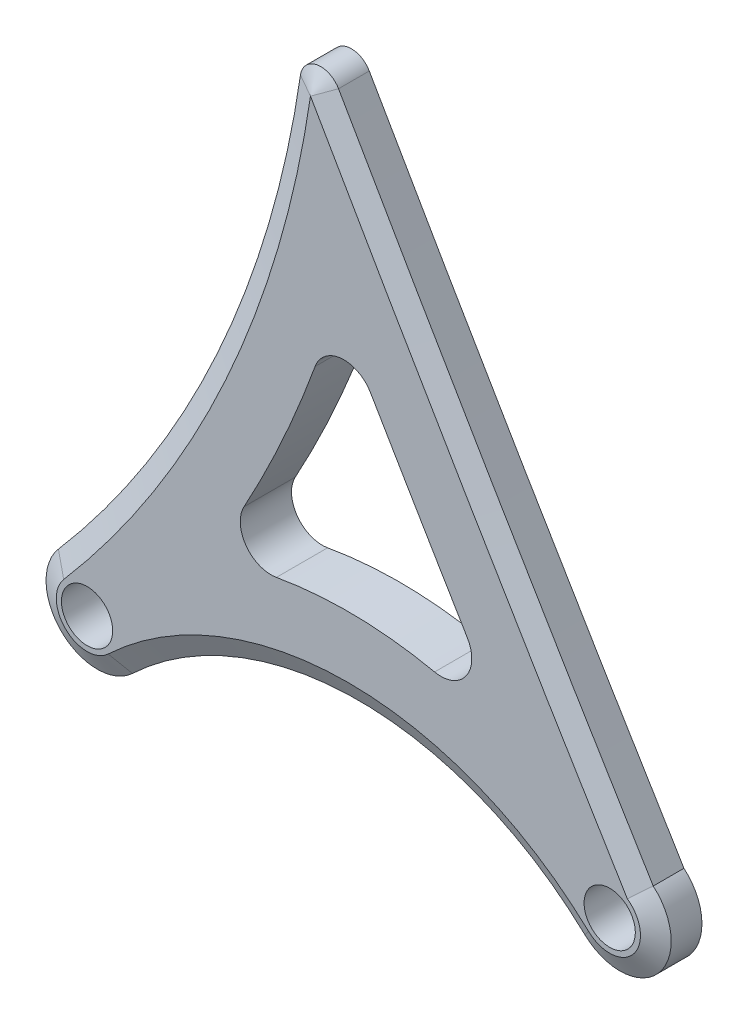
ISO-10303-21;
HEADER;
FILE_DESCRIPTION(('STEP AP214'),'2;1');
FILE_NAME('part.step','',(''),(''),'','','');
FILE_SCHEMA(('AUTOMOTIVE_DESIGN { 1 0 10303 214 1 1 1 1 }'));
ENDSEC;
DATA;
#1=APPLICATION_CONTEXT('core data for automotive mechanical design processes');
#2=APPLICATION_PROTOCOL_DEFINITION('international standard','automotive_design',2000,#1);
#3=PRODUCT_CONTEXT('',#1,'mechanical');
#4=PRODUCT('Part','Part','',(#3));
#5=PRODUCT_RELATED_PRODUCT_CATEGORY('part','',(#4));
#6=PRODUCT_DEFINITION_FORMATION('','',#4);
#7=PRODUCT_DEFINITION_CONTEXT('part definition',#1,'design');
#8=PRODUCT_DEFINITION('design','',#6,#7);
#9=PRODUCT_DEFINITION_SHAPE('','',#8);
#10=(LENGTH_UNIT() NAMED_UNIT(*) SI_UNIT(.MILLI.,.METRE.));
#11=(NAMED_UNIT(*) PLANE_ANGLE_UNIT() SI_UNIT($,.RADIAN.));
#12=(NAMED_UNIT(*) SI_UNIT($,.STERADIAN.) SOLID_ANGLE_UNIT());
#13=UNCERTAINTY_MEASURE_WITH_UNIT(LENGTH_MEASURE(1.E-05),#10,'distance_accuracy_value','');
#14=(GEOMETRIC_REPRESENTATION_CONTEXT(3) GLOBAL_UNCERTAINTY_ASSIGNED_CONTEXT((#13)) GLOBAL_UNIT_ASSIGNED_CONTEXT((#10,
#11,#12)) REPRESENTATION_CONTEXT('',''));
#15=CARTESIAN_POINT('',(0.,0.,0.));
#16=DIRECTION('',(0.,0.,1.));
#17=DIRECTION('',(1.,0.,0.));
#18=AXIS2_PLACEMENT_3D('',#15,#16,#17);
#19=CARTESIAN_POINT('',(0.,0.,2.5));
#20=DIRECTION('',(0.,0.,1.));
#21=DIRECTION('',(1.,0.,0.));
#22=AXIS2_PLACEMENT_3D('',#19,#20,#21);
#23=PLANE('',#22);
#24=CARTESIAN_POINT('',(-81.5058371751675,69.9530806072652,2.5));
#25=DIRECTION('',(0.,0.,1.));
#26=DIRECTION('',(1.,0.,0.));
#27=AXIS2_PLACEMENT_3D('',#24,#25,#26);
#28=CIRCLE('',#27,104.408728602807);
#29=CARTESIAN_POINT('',(21.8025261402931,54.8347249581167,2.5));
#30=VERTEX_POINT('',#29);
#31=CARTESIAN_POINT('',(-2.27651434577275,1.95383787287753,2.5));
#32=VERTEX_POINT('',#31);
#33=EDGE_CURVE('E243',#30,#32,#28,.F.);
#34=ORIENTED_EDGE('',*,*,#33,.T.);
#35=CARTESIAN_POINT('',(0.,0.,2.5));
#36=DIRECTION('',(0.,0.,1.));
#37=DIRECTION('',(1.,0.,0.));
#38=AXIS2_PLACEMENT_3D('',#35,#36,#37);
#39=CIRCLE('',#38,2.99999999999998);
#40=CARTESIAN_POINT('',(2.05722545944654,-2.18353461364936,2.5));
#41=VERTEX_POINT('',#40);
#42=EDGE_CURVE('E245',#32,#41,#39,.T.);
#43=ORIENTED_EDGE('',*,*,#42,.T.);
#44=CARTESIAN_POINT('',(25.5,-27.0656443572491,2.5));
#45=DIRECTION('',(0.,0.,1.));
#46=DIRECTION('',(1.,0.,0.));
#47=AXIS2_PLACEMENT_3D('',#44,#45,#46);
#48=CIRCLE('',#47,34.1860068368882);
#49=CARTESIAN_POINT('',(48.9427745405534,-2.18353461364937,2.5));
#50=VERTEX_POINT('',#49);
#51=EDGE_CURVE('E241',#41,#50,#48,.F.);
#52=ORIENTED_EDGE('',*,*,#51,.T.);
#53=CARTESIAN_POINT('',(51.,0.,2.5));
#54=DIRECTION('',(0.,0.,1.));
#55=DIRECTION('',(1.,0.,0.));
#56=AXIS2_PLACEMENT_3D('',#53,#54,#55);
#57=CIRCLE('',#56,2.99999999999999);
#58=CARTESIAN_POINT('',(52.726541754673,2.45337595353229,2.5));
#59=VERTEX_POINT('',#58);
#60=EDGE_CURVE('E239',#50,#59,#57,.T.);
#61=ORIENTED_EDGE('',*,*,#60,.T.);
#62=CARTESIAN_POINT('',(1817.84999058361,1079.83600160116,2.5));
#63=DIRECTION('',(0.,0.,1.));
#64=DIRECTION('',(1.,0.,0.));
#65=AXIS2_PLACEMENT_3D('',#62,#63,#64);
#66=CIRCLE('',#65,2067.94925267839);
#67=EDGE_CURVE('E237',#59,#30,#66,.F.);
#68=ORIENTED_EDGE('',*,*,#67,.T.);
#69=EDGE_LOOP('',(#34,#43,#52,#61,#68));
#70=FACE_BOUND('',#69,.T.);
#71=CARTESIAN_POINT('',(0.,0.,2.5));
#72=DIRECTION('',(0.,0.,1.));
#73=DIRECTION('',(1.,0.,0.));
#74=AXIS2_PLACEMENT_3D('',#71,#72,#73);
#75=CIRCLE('',#74,2.5);
#76=CARTESIAN_POINT('',(2.5,0.,2.5));
#77=VERTEX_POINT('',#76);
#78=EDGE_CURVE('E221',#77,#77,#75,.T.);
#79=ORIENTED_EDGE('',*,*,#78,.F.);
#80=EDGE_LOOP('',(#79));
#81=FACE_BOUND('',#80,.T.);
#82=CARTESIAN_POINT('',(51.,0.,2.5));
#83=DIRECTION('',(0.,0.,1.));
#84=DIRECTION('',(1.,0.,0.));
#85=AXIS2_PLACEMENT_3D('',#82,#83,#84);
#86=CIRCLE('',#85,2.5);
#87=CARTESIAN_POINT('',(53.5,0.,2.5));
#88=VERTEX_POINT('',#87);
#89=EDGE_CURVE('E227',#88,#88,#86,.T.);
#90=ORIENTED_EDGE('',*,*,#89,.F.);
#91=EDGE_LOOP('',(#90));
#92=FACE_BOUND('',#91,.T.);
#93=CARTESIAN_POINT('',(34.5411682834786,15.1633558983287,2.5));
#94=DIRECTION('',(0.,0.,1.));
#95=DIRECTION('',(-1.,0.,0.));
#96=AXIS2_PLACEMENT_3D('',#93,#94,#95);
#97=CIRCLE('',#96,3.0000000000001);
#98=CARTESIAN_POINT('',(33.9131059355778,12.2298362227256,2.5));
#99=VERTEX_POINT('',#98);
#100=CARTESIAN_POINT('',(37.1170263406755,16.7011970049373,2.5));
#101=VERTEX_POINT('',#100);
#102=EDGE_CURVE('E160',#99,#101,#97,.T.);
#103=ORIENTED_EDGE('',*,*,#102,.F.);
#104=CARTESIAN_POINT('',(25.5,-27.0656443572491,2.5));
#105=DIRECTION('',(0.,0.,-1.));
#106=DIRECTION('',(1.,0.,0.));
#107=AXIS2_PLACEMENT_3D('',#104,#105,#106);
#108=CIRCLE('',#107,40.1860068368882);
#109=CARTESIAN_POINT('',(18.4748148405109,12.50153799087,2.5));
#110=VERTEX_POINT('',#109);
#111=EDGE_CURVE('E178',#110,#99,#108,.T.);
#112=ORIENTED_EDGE('',*,*,#111,.F.);
#113=CARTESIAN_POINT('',(17.9503647361746,15.4553409782173,2.5));
#114=DIRECTION('',(0.,0.,1.));
#115=DIRECTION('',(-1.,0.,0.));
#116=AXIS2_PLACEMENT_3D('',#113,#114,#115);
#117=CIRCLE('',#116,3.00000000000001);
#118=CARTESIAN_POINT('',(15.3194507896916,16.8969691571183,2.5));
#119=VERTEX_POINT('',#118);
#120=EDGE_CURVE('E181',#119,#110,#117,.T.);
#121=ORIENTED_EDGE('',*,*,#120,.F.);
#122=CARTESIAN_POINT('',(-81.5058371751675,69.9530806072652,2.5));
#123=DIRECTION('',(0.,0.,-1.));
#124=DIRECTION('',(1.,0.,0.));
#125=AXIS2_PLACEMENT_3D('',#122,#123,#124);
#126=CIRCLE('',#125,110.408728602807);
#127=CARTESIAN_POINT('',(22.25234591704,32.2128263276202,2.5));
#128=VERTEX_POINT('',#127);
#129=EDGE_CURVE('E198',#128,#119,#126,.T.);
#130=ORIENTED_EDGE('',*,*,#129,.F.);
#131=CARTESIAN_POINT('',(25.0716388589634,31.1873570167087,2.5));
#132=DIRECTION('',(0.,0.,1.));
#133=DIRECTION('',(1.,0.,0.));
#134=AXIS2_PLACEMENT_3D('',#131,#132,#133);
#135=CIRCLE('',#134,3.00000000000012);
#136=CARTESIAN_POINT('',(27.6611749529423,32.7020526356305,2.5));
#137=VERTEX_POINT('',#136);
#138=EDGE_CURVE('E195',#137,#128,#135,.T.);
#139=ORIENTED_EDGE('',*,*,#138,.F.);
#140=CARTESIAN_POINT('',(1817.84999058361,1079.83600160116,2.5));
#141=DIRECTION('',(0.,0.,-1.));
#142=DIRECTION('',(1.,0.,0.));
#143=AXIS2_PLACEMENT_3D('',#140,#141,#142);
#144=CIRCLE('',#143,2073.94925267839);
#145=EDGE_CURVE('E192',#101,#137,#144,.T.);
#146=ORIENTED_EDGE('',*,*,#145,.F.);
#147=EDGE_LOOP('',(#103,#112,#121,#130,#139,#146));
#148=FACE_BOUND('',#147,.T.);
#149=ADVANCED_FACE('F34',(#70,#81,#92,#148),#23,.T.);
#150=CARTESIAN_POINT('',(0.,0.,-2.5));
#151=DIRECTION('',(0.,0.,1.));
#152=DIRECTION('',(1.,0.,0.));
#153=AXIS2_PLACEMENT_3D('',#150,#151,#152);
#154=PLANE('',#153);
#155=CARTESIAN_POINT('',(25.5,-27.0656443572491,-2.5));
#156=DIRECTION('',(0.,0.,1.));
#157=DIRECTION('',(1.,0.,0.));
#158=AXIS2_PLACEMENT_3D('',#155,#156,#157);
#159=CIRCLE('',#158,34.1860068368878);
#160=CARTESIAN_POINT('',(48.9427745405532,-2.18353461364959,-2.5));
#161=VERTEX_POINT('',#160);
#162=CARTESIAN_POINT('',(2.05722545944676,-2.18353461364958,-2.5));
#163=VERTEX_POINT('',#162);
#164=EDGE_CURVE('E345',#161,#163,#159,.T.);
#165=ORIENTED_EDGE('',*,*,#164,.T.);
#166=CARTESIAN_POINT('',(0.,0.,-2.5));
#167=DIRECTION('',(0.,0.,1.));
#168=DIRECTION('',(1.,0.,0.));
#169=AXIS2_PLACEMENT_3D('',#166,#167,#168);
#170=CIRCLE('',#169,3.00000000000029);
#171=CARTESIAN_POINT('',(-2.27651434577301,1.95383787287775,-2.5));
#172=VERTEX_POINT('',#171);
#173=EDGE_CURVE('E340',#163,#172,#170,.F.);
#174=ORIENTED_EDGE('',*,*,#173,.T.);
#175=CARTESIAN_POINT('',(-81.5058371751675,69.9530806072652,-2.5));
#176=DIRECTION('',(0.,0.,1.));
#177=DIRECTION('',(1.,0.,0.));
#178=AXIS2_PLACEMENT_3D('',#175,#176,#177);
#179=CIRCLE('',#178,104.408728602807);
#180=CARTESIAN_POINT('',(21.8025261402934,54.8347249581169,-2.5));
#181=VERTEX_POINT('',#180);
#182=EDGE_CURVE('E343',#172,#181,#179,.T.);
#183=ORIENTED_EDGE('',*,*,#182,.T.);
#184=CARTESIAN_POINT('',(1817.84999058361,1079.83600160116,-2.5));
#185=DIRECTION('',(0.,0.,1.));
#186=DIRECTION('',(1.,0.,0.));
#187=AXIS2_PLACEMENT_3D('',#184,#185,#186);
#188=CIRCLE('',#187,2067.94925267839);
#189=CARTESIAN_POINT('',(52.7265417546742,2.45337595353186,-2.5));
#190=VERTEX_POINT('',#189);
#191=EDGE_CURVE('E349',#181,#190,#188,.T.);
#192=ORIENTED_EDGE('',*,*,#191,.T.);
#193=CARTESIAN_POINT('',(51.,0.,-2.5));
#194=DIRECTION('',(0.,0.,1.));
#195=DIRECTION('',(1.,0.,0.));
#196=AXIS2_PLACEMENT_3D('',#193,#194,#195);
#197=CIRCLE('',#196,3.0000000000003);
#198=EDGE_CURVE('E347',#190,#161,#197,.F.);
#199=ORIENTED_EDGE('',*,*,#198,.T.);
#200=EDGE_LOOP('',(#165,#174,#183,#192,#199));
#201=FACE_BOUND('',#200,.T.);
#202=CARTESIAN_POINT('',(51.,0.,-2.5));
#203=DIRECTION('',(0.,0.,1.));
#204=DIRECTION('',(1.,0.,0.));
#205=AXIS2_PLACEMENT_3D('',#202,#203,#204);
#206=CIRCLE('',#205,2.5);
#207=CARTESIAN_POINT('',(53.5,0.,-2.5));
#208=VERTEX_POINT('',#207);
#209=EDGE_CURVE('E224',#208,#208,#206,.T.);
#210=ORIENTED_EDGE('',*,*,#209,.T.);
#211=EDGE_LOOP('',(#210));
#212=FACE_BOUND('',#211,.T.);
#213=CARTESIAN_POINT('',(0.,0.,-2.5));
#214=DIRECTION('',(0.,0.,1.));
#215=DIRECTION('',(1.,0.,0.));
#216=AXIS2_PLACEMENT_3D('',#213,#214,#215);
#217=CIRCLE('',#216,2.5);
#218=CARTESIAN_POINT('',(2.5,0.,-2.5));
#219=VERTEX_POINT('',#218);
#220=EDGE_CURVE('E215',#219,#219,#217,.T.);
#221=ORIENTED_EDGE('',*,*,#220,.T.);
#222=EDGE_LOOP('',(#221));
#223=FACE_BOUND('',#222,.T.);
#224=CARTESIAN_POINT('',(25.5,-27.0656443572491,-2.5));
#225=DIRECTION('',(0.,0.,-1.));
#226=DIRECTION('',(1.,0.,0.));
#227=AXIS2_PLACEMENT_3D('',#224,#225,#226);
#228=CIRCLE('',#227,40.1860068368882);
#229=CARTESIAN_POINT('',(18.4748148405109,12.50153799087,-2.5));
#230=VERTEX_POINT('',#229);
#231=CARTESIAN_POINT('',(33.9131059355778,12.2298362227256,-2.5));
#232=VERTEX_POINT('',#231);
#233=EDGE_CURVE('E165',#230,#232,#228,.T.);
#234=ORIENTED_EDGE('',*,*,#233,.T.);
#235=CARTESIAN_POINT('',(34.5411682834786,15.1633558983287,-2.5));
#236=DIRECTION('',(0.,0.,1.));
#237=DIRECTION('',(-1.,0.,0.));
#238=AXIS2_PLACEMENT_3D('',#235,#236,#237);
#239=CIRCLE('',#238,3.0000000000001);
#240=CARTESIAN_POINT('',(37.1170263406755,16.7011970049373,-2.5));
#241=VERTEX_POINT('',#240);
#242=EDGE_CURVE('E157',#232,#241,#239,.T.);
#243=ORIENTED_EDGE('',*,*,#242,.T.);
#244=CARTESIAN_POINT('',(1817.84999058361,1079.83600160116,-2.5));
#245=DIRECTION('',(0.,0.,-1.));
#246=DIRECTION('',(1.,0.,0.));
#247=AXIS2_PLACEMENT_3D('',#244,#245,#246);
#248=CIRCLE('',#247,2073.94925267839);
#249=CARTESIAN_POINT('',(27.6611749529423,32.7020526356305,-2.5));
#250=VERTEX_POINT('',#249);
#251=EDGE_CURVE('E169',#241,#250,#248,.T.);
#252=ORIENTED_EDGE('',*,*,#251,.T.);
#253=CARTESIAN_POINT('',(25.0716388589634,31.1873570167087,-2.5));
#254=DIRECTION('',(0.,0.,1.));
#255=DIRECTION('',(1.,0.,0.));
#256=AXIS2_PLACEMENT_3D('',#253,#254,#255);
#257=CIRCLE('',#256,3.00000000000012);
#258=CARTESIAN_POINT('',(22.25234591704,32.2128263276202,-2.5));
#259=VERTEX_POINT('',#258);
#260=EDGE_CURVE('E173',#250,#259,#257,.T.);
#261=ORIENTED_EDGE('',*,*,#260,.T.);
#262=CARTESIAN_POINT('',(-81.5058371751675,69.9530806072652,-2.5));
#263=DIRECTION('',(0.,0.,-1.));
#264=DIRECTION('',(1.,0.,0.));
#265=AXIS2_PLACEMENT_3D('',#262,#263,#264);
#266=CIRCLE('',#265,110.408728602807);
#267=CARTESIAN_POINT('',(15.3194507896916,16.8969691571183,-2.5));
#268=VERTEX_POINT('',#267);
#269=EDGE_CURVE('E185',#259,#268,#266,.T.);
#270=ORIENTED_EDGE('',*,*,#269,.T.);
#271=CARTESIAN_POINT('',(17.9503647361746,15.4553409782173,-2.5));
#272=DIRECTION('',(0.,0.,1.));
#273=DIRECTION('',(-1.,0.,0.));
#274=AXIS2_PLACEMENT_3D('',#271,#272,#273);
#275=CIRCLE('',#274,3.00000000000001);
#276=EDGE_CURVE('E188',#268,#230,#275,.T.);
#277=ORIENTED_EDGE('',*,*,#276,.T.);
#278=EDGE_LOOP('',(#234,#243,#252,#261,#270,#277));
#279=FACE_BOUND('',#278,.T.);
#280=ADVANCED_FACE('F175',(#201,#212,#223,#279),#154,.F.);
#281=CARTESIAN_POINT('',(0.,0.,2.5));
#282=DIRECTION('',(0.,0.,-1.));
#283=DIRECTION('',(-1.,0.,0.));
#284=AXIS2_PLACEMENT_3D('',#281,#282,#283);
#285=CYLINDRICAL_SURFACE('',#284,5.);
#286=DIRECTION('',(0.,0.,1.));
#287=VECTOR('',#286,1.);
#288=CARTESIAN_POINT('',(-3.79419057628796,3.25639645479592,-2.5));
#289=LINE('',#288,#287);
#290=CARTESIAN_POINT('',(-3.79419057628796,3.25639645479592,-1.50000000000005));
#291=VERTEX_POINT('',#290);
#292=CARTESIAN_POINT('',(-3.79419057628796,3.25639645479592,1.50000000000005));
#293=VERTEX_POINT('',#292);
#294=EDGE_CURVE('E205',#291,#293,#289,.T.);
#295=ORIENTED_EDGE('',*,*,#294,.F.);
#296=CARTESIAN_POINT('',(0.,0.,-1.50000000000005));
#297=DIRECTION('',(0.,0.,1.));
#298=DIRECTION('',(1.,0.,0.));
#299=AXIS2_PLACEMENT_3D('',#296,#297,#298);
#300=CIRCLE('',#299,5.);
#301=CARTESIAN_POINT('',(3.42870909907759,-3.63922435608229,-1.50000000000005));
#302=VERTEX_POINT('',#301);
#303=EDGE_CURVE('E265',#291,#302,#300,.T.);
#304=ORIENTED_EDGE('',*,*,#303,.T.);
#305=DIRECTION('',(0.,0.,1.));
#306=VECTOR('',#305,1.);
#307=CARTESIAN_POINT('',(3.42870909907759,-3.63922435608229,-2.5));
#308=LINE('',#307,#306);
#309=CARTESIAN_POINT('',(3.42870909907759,-3.63922435608229,1.50000000000005));
#310=VERTEX_POINT('',#309);
#311=EDGE_CURVE('E218',#302,#310,#308,.T.);
#312=ORIENTED_EDGE('',*,*,#311,.T.);
#313=CARTESIAN_POINT('',(0.,0.,1.50000000000005));
#314=DIRECTION('',(0.,0.,1.));
#315=DIRECTION('',(1.,0.,0.));
#316=AXIS2_PLACEMENT_3D('',#313,#314,#315);
#317=CIRCLE('',#316,5.);
#318=EDGE_CURVE('E248',#310,#293,#317,.F.);
#319=ORIENTED_EDGE('',*,*,#318,.T.);
#320=EDGE_LOOP('',(#295,#304,#312,#319));
#321=FACE_BOUND('',#320,.T.);
#322=ADVANCED_FACE('F355',(#321),#285,.T.);
#323=CARTESIAN_POINT('',(51.,0.,2.5));
#324=DIRECTION('',(0.,0.,-1.));
#325=DIRECTION('',(-1.,0.,0.));
#326=AXIS2_PLACEMENT_3D('',#323,#324,#325);
#327=CYLINDRICAL_SURFACE('',#326,5.00000000000001);
#328=DIRECTION('',(0.,0.,1.));
#329=VECTOR('',#328,1.);
#330=CARTESIAN_POINT('',(47.5712909009225,-3.63922435608214,-2.5));
#331=LINE('',#330,#329);
#332=CARTESIAN_POINT('',(47.5712909009225,-3.63922435608214,-1.50000000000005));
#333=VERTEX_POINT('',#332);
#334=CARTESIAN_POINT('',(47.5712909009225,-3.63922435608214,1.50000000000005));
#335=VERTEX_POINT('',#334);
#336=EDGE_CURVE('E216',#333,#335,#331,.T.);
#337=ORIENTED_EDGE('',*,*,#336,.F.);
#338=CARTESIAN_POINT('',(51.,0.,-1.50000000000005));
#339=DIRECTION('',(0.,0.,1.));
#340=DIRECTION('',(1.,0.,0.));
#341=AXIS2_PLACEMENT_3D('',#338,#339,#340);
#342=CIRCLE('',#341,5.00000000000001);
#343=CARTESIAN_POINT('',(54.2457341107163,3.80331566958758,-1.50000000000005));
#344=VERTEX_POINT('',#343);
#345=EDGE_CURVE('E43',#333,#344,#342,.T.);
#346=ORIENTED_EDGE('',*,*,#345,.T.);
#347=DIRECTION('',(0.,0.,1.));
#348=VECTOR('',#347,1.);
#349=CARTESIAN_POINT('',(54.2457341107163,3.80331566958758,-2.5));
#350=LINE('',#349,#348);
#351=CARTESIAN_POINT('',(54.2457341107163,3.80331566958758,1.50000000000005));
#352=VERTEX_POINT('',#351);
#353=EDGE_CURVE('E213',#344,#352,#350,.T.);
#354=ORIENTED_EDGE('',*,*,#353,.T.);
#355=CARTESIAN_POINT('',(51.,0.,1.50000000000005));
#356=DIRECTION('',(0.,0.,1.));
#357=DIRECTION('',(1.,0.,0.));
#358=AXIS2_PLACEMENT_3D('',#355,#356,#357);
#359=CIRCLE('',#358,5.00000000000001);
#360=EDGE_CURVE('E259',#352,#335,#359,.F.);
#361=ORIENTED_EDGE('',*,*,#360,.T.);
#362=EDGE_LOOP('',(#337,#346,#354,#361));
#363=FACE_BOUND('',#362,.T.);
#364=ADVANCED_FACE('F424',(#363),#327,.T.);
#365=CARTESIAN_POINT('',(51.,0.,2.5));
#366=DIRECTION('',(0.,0.,-1.));
#367=DIRECTION('',(-1.,0.,0.));
#368=AXIS2_PLACEMENT_3D('',#365,#366,#367);
#369=CYLINDRICAL_SURFACE('',#368,2.5);
#370=ORIENTED_EDGE('',*,*,#89,.T.);
#371=EDGE_LOOP('',(#370));
#372=FACE_BOUND('',#371,.T.);
#373=ORIENTED_EDGE('',*,*,#209,.F.);
#374=EDGE_LOOP('',(#373));
#375=FACE_BOUND('',#374,.T.);
#376=ADVANCED_FACE('F416',(#372,#375),#369,.F.);
#377=CARTESIAN_POINT('',(0.,0.,2.5));
#378=DIRECTION('',(0.,0.,-1.));
#379=DIRECTION('',(-1.,0.,0.));
#380=AXIS2_PLACEMENT_3D('',#377,#378,#379);
#381=CYLINDRICAL_SURFACE('',#380,2.5);
#382=ORIENTED_EDGE('',*,*,#78,.T.);
#383=EDGE_LOOP('',(#382));
#384=FACE_BOUND('',#383,.T.);
#385=ORIENTED_EDGE('',*,*,#220,.F.);
#386=EDGE_LOOP('',(#385));
#387=FACE_BOUND('',#386,.T.);
#388=ADVANCED_FACE('F414',(#384,#387),#381,.F.);
#389=CARTESIAN_POINT('',(1817.84999058361,1079.83600160116,-2.5));
#390=DIRECTION('',(0.,0.,1.));
#391=DIRECTION('',(1.,0.,0.));
#392=AXIS2_PLACEMENT_3D('',#389,#390,#391);
#393=CYLINDRICAL_SURFACE('',#392,2065.94925267839);
#394=ORIENTED_EDGE('',*,*,#353,.F.);
#395=CARTESIAN_POINT('',(1817.84999058361,1079.83600160116,-1.50000000000005));
#396=DIRECTION('',(0.,0.,1.));
#397=DIRECTION('',(1.,0.,0.));
#398=AXIS2_PLACEMENT_3D('',#395,#396,#397);
#399=CIRCLE('',#398,2065.94925267839);
#400=CARTESIAN_POINT('',(23.5395585767682,55.8260464572449,-1.50000000000005));
#401=VERTEX_POINT('',#400);
#402=EDGE_CURVE('E12',#344,#401,#399,.F.);
#403=ORIENTED_EDGE('',*,*,#402,.T.);
#404=DIRECTION('',(0.,0.,1.));
#405=VECTOR('',#404,1.);
#406=CARTESIAN_POINT('',(23.5395585767682,55.8260464572449,-2.5));
#407=LINE('',#406,#405);
#408=CARTESIAN_POINT('',(23.5395585767682,55.8260464572449,1.50000000000005));
#409=VERTEX_POINT('',#408);
#410=EDGE_CURVE('E230',#401,#409,#407,.T.);
#411=ORIENTED_EDGE('',*,*,#410,.T.);
#412=CARTESIAN_POINT('',(1817.84999058361,1079.83600160116,1.50000000000005));
#413=DIRECTION('',(0.,0.,1.));
#414=DIRECTION('',(1.,0.,0.));
#415=AXIS2_PLACEMENT_3D('',#412,#413,#414);
#416=CIRCLE('',#415,2065.94925267839);
#417=EDGE_CURVE('E262',#409,#352,#416,.T.);
#418=ORIENTED_EDGE('',*,*,#417,.T.);
#419=EDGE_LOOP('',(#394,#403,#411,#418));
#420=FACE_BOUND('',#419,.T.);
#421=ADVANCED_FACE('F392',(#420),#393,.F.);
#422=CARTESIAN_POINT('',(-81.5058371751675,69.9530806072652,-2.5));
#423=DIRECTION('',(0.,0.,1.));
#424=DIRECTION('',(1.,0.,0.));
#425=AXIS2_PLACEMENT_3D('',#422,#423,#424);
#426=CYLINDRICAL_SURFACE('',#425,102.408728602807);
#427=DIRECTION('',(0.,0.,1.));
#428=VECTOR('',#427,1.);
#429=CARTESIAN_POINT('',(19.8236041727983,55.1243244169251,-2.5));
#430=LINE('',#429,#428);
#431=CARTESIAN_POINT('',(19.8236041727983,55.1243244169251,1.50000000000005));
#432=VERTEX_POINT('',#431);
#433=CARTESIAN_POINT('',(19.8236041727983,55.1243244169251,-1.50000000000005));
#434=VERTEX_POINT('',#433);
#435=EDGE_CURVE('E234',#432,#434,#430,.F.);
#436=ORIENTED_EDGE('',*,*,#435,.T.);
#437=CARTESIAN_POINT('',(-81.5058371751675,69.9530806072652,-1.50000000000005));
#438=DIRECTION('',(0.,0.,1.));
#439=DIRECTION('',(1.,0.,0.));
#440=AXIS2_PLACEMENT_3D('',#437,#438,#439);
#441=CIRCLE('',#440,102.408728602807);
#442=EDGE_CURVE('E338',#434,#291,#441,.F.);
#443=ORIENTED_EDGE('',*,*,#442,.T.);
#444=ORIENTED_EDGE('',*,*,#294,.T.);
#445=CARTESIAN_POINT('',(-81.5058371751675,69.9530806072652,1.50000000000005));
#446=DIRECTION('',(0.,0.,1.));
#447=DIRECTION('',(1.,0.,0.));
#448=AXIS2_PLACEMENT_3D('',#445,#446,#447);
#449=CIRCLE('',#448,102.408728602807);
#450=EDGE_CURVE('E251',#293,#432,#449,.T.);
#451=ORIENTED_EDGE('',*,*,#450,.T.);
#452=EDGE_LOOP('',(#436,#443,#444,#451));
#453=FACE_BOUND('',#452,.T.);
#454=ADVANCED_FACE('F383',(#453),#426,.F.);
#455=CARTESIAN_POINT('',(25.5,-27.0656443572491,-2.5));
#456=DIRECTION('',(0.,0.,1.));
#457=DIRECTION('',(1.,0.,0.));
#458=AXIS2_PLACEMENT_3D('',#455,#456,#457);
#459=CYLINDRICAL_SURFACE('',#458,32.1860068368881);
#460=ORIENTED_EDGE('',*,*,#311,.F.);
#461=CARTESIAN_POINT('',(25.5,-27.0656443572491,-1.50000000000005));
#462=DIRECTION('',(0.,0.,1.));
#463=DIRECTION('',(1.,0.,0.));
#464=AXIS2_PLACEMENT_3D('',#461,#462,#463);
#465=CIRCLE('',#464,32.1860068368881);
#466=EDGE_CURVE('E336',#302,#333,#465,.F.);
#467=ORIENTED_EDGE('',*,*,#466,.T.);
#468=ORIENTED_EDGE('',*,*,#336,.T.);
#469=CARTESIAN_POINT('',(25.5,-27.0656443572491,1.50000000000005));
#470=DIRECTION('',(0.,0.,1.));
#471=DIRECTION('',(1.,0.,0.));
#472=AXIS2_PLACEMENT_3D('',#469,#470,#471);
#473=CIRCLE('',#472,32.1860068368881);
#474=EDGE_CURVE('E253',#335,#310,#473,.T.);
#475=ORIENTED_EDGE('',*,*,#474,.T.);
#476=EDGE_LOOP('',(#460,#467,#468,#475));
#477=FACE_BOUND('',#476,.T.);
#478=ADVANCED_FACE('F358',(#477),#459,.F.);
#479=CARTESIAN_POINT('',(34.5411682834786,15.1633558983287,-2.5));
#480=DIRECTION('',(0.,0.,1.));
#481=DIRECTION('',(1.,0.,0.));
#482=AXIS2_PLACEMENT_3D('',#479,#480,#481);
#483=CYLINDRICAL_SURFACE('',#482,3.0000000000001);
#484=ORIENTED_EDGE('',*,*,#102,.T.);
#485=DIRECTION('',(0.,0.,1.));
#486=VECTOR('',#485,1.);
#487=CARTESIAN_POINT('',(37.1170263406755,16.7011970049373,-2.5));
#488=LINE('',#487,#486);
#489=EDGE_CURVE('E153',#241,#101,#488,.T.);
#490=ORIENTED_EDGE('',*,*,#489,.F.);
#491=ORIENTED_EDGE('',*,*,#242,.F.);
#492=DIRECTION('',(0.,0.,1.));
#493=VECTOR('',#492,1.);
#494=CARTESIAN_POINT('',(33.9131059355778,12.2298362227256,-2.5));
#495=LINE('',#494,#493);
#496=EDGE_CURVE('E203',#232,#99,#495,.T.);
#497=ORIENTED_EDGE('',*,*,#496,.T.);
#498=EDGE_LOOP('',(#484,#490,#491,#497));
#499=FACE_BOUND('',#498,.T.);
#500=ADVANCED_FACE('F155',(#499),#483,.F.);
#501=CARTESIAN_POINT('',(25.5,-27.0656443572491,-2.5));
#502=DIRECTION('',(0.,0.,1.));
#503=DIRECTION('',(1.,0.,0.));
#504=AXIS2_PLACEMENT_3D('',#501,#502,#503);
#505=CYLINDRICAL_SURFACE('',#504,40.1860068368882);
#506=ORIENTED_EDGE('',*,*,#111,.T.);
#507=ORIENTED_EDGE('',*,*,#496,.F.);
#508=ORIENTED_EDGE('',*,*,#233,.F.);
#509=DIRECTION('',(0.,0.,1.));
#510=VECTOR('',#509,1.);
#511=CARTESIAN_POINT('',(18.4748148405109,12.50153799087,-2.5));
#512=LINE('',#511,#510);
#513=EDGE_CURVE('E206',#230,#110,#512,.T.);
#514=ORIENTED_EDGE('',*,*,#513,.T.);
#515=EDGE_LOOP('',(#506,#507,#508,#514));
#516=FACE_BOUND('',#515,.T.);
#517=ADVANCED_FACE('F492',(#516),#505,.T.);
#518=CARTESIAN_POINT('',(17.9503647361746,15.4553409782173,-2.5));
#519=DIRECTION('',(0.,0.,1.));
#520=DIRECTION('',(1.,0.,0.));
#521=AXIS2_PLACEMENT_3D('',#518,#519,#520);
#522=CYLINDRICAL_SURFACE('',#521,3.00000000000001);
#523=ORIENTED_EDGE('',*,*,#120,.T.);
#524=ORIENTED_EDGE('',*,*,#513,.F.);
#525=ORIENTED_EDGE('',*,*,#276,.F.);
#526=DIRECTION('',(0.,0.,1.));
#527=VECTOR('',#526,1.);
#528=CARTESIAN_POINT('',(15.3194507896916,16.8969691571183,-2.5));
#529=LINE('',#528,#527);
#530=EDGE_CURVE('E208',#268,#119,#529,.T.);
#531=ORIENTED_EDGE('',*,*,#530,.T.);
#532=EDGE_LOOP('',(#523,#524,#525,#531));
#533=FACE_BOUND('',#532,.T.);
#534=ADVANCED_FACE('F484',(#533),#522,.F.);
#535=CARTESIAN_POINT('',(-81.5058371751675,69.9530806072652,-2.5));
#536=DIRECTION('',(0.,0.,1.));
#537=DIRECTION('',(1.,0.,0.));
#538=AXIS2_PLACEMENT_3D('',#535,#536,#537);
#539=CYLINDRICAL_SURFACE('',#538,110.408728602807);
#540=ORIENTED_EDGE('',*,*,#129,.T.);
#541=ORIENTED_EDGE('',*,*,#530,.F.);
#542=ORIENTED_EDGE('',*,*,#269,.F.);
#543=DIRECTION('',(0.,0.,1.));
#544=VECTOR('',#543,1.);
#545=CARTESIAN_POINT('',(22.25234591704,32.2128263276202,-2.5));
#546=LINE('',#545,#544);
#547=EDGE_CURVE('E210',#259,#128,#546,.T.);
#548=ORIENTED_EDGE('',*,*,#547,.T.);
#549=EDGE_LOOP('',(#540,#541,#542,#548));
#550=FACE_BOUND('',#549,.T.);
#551=ADVANCED_FACE('F476',(#550),#539,.T.);
#552=CARTESIAN_POINT('',(25.0716388589634,31.1873570167087,-2.5));
#553=DIRECTION('',(0.,0.,1.));
#554=DIRECTION('',(1.,0.,0.));
#555=AXIS2_PLACEMENT_3D('',#552,#553,#554);
#556=CYLINDRICAL_SURFACE('',#555,3.00000000000012);
#557=ORIENTED_EDGE('',*,*,#138,.T.);
#558=ORIENTED_EDGE('',*,*,#547,.F.);
#559=ORIENTED_EDGE('',*,*,#260,.F.);
#560=DIRECTION('',(0.,0.,1.));
#561=VECTOR('',#560,1.);
#562=CARTESIAN_POINT('',(27.6611749529423,32.7020526356305,-2.5));
#563=LINE('',#562,#561);
#564=EDGE_CURVE('E164',#250,#137,#563,.T.);
#565=ORIENTED_EDGE('',*,*,#564,.T.);
#566=EDGE_LOOP('',(#557,#558,#559,#565));
#567=FACE_BOUND('',#566,.T.);
#568=ADVANCED_FACE('F469',(#567),#556,.F.);
#569=CARTESIAN_POINT('',(1817.84999058361,1079.83600160116,-2.5));
#570=DIRECTION('',(0.,0.,1.));
#571=DIRECTION('',(1.,0.,0.));
#572=AXIS2_PLACEMENT_3D('',#569,#570,#571);
#573=CYLINDRICAL_SURFACE('',#572,2073.94925267839);
#574=ORIENTED_EDGE('',*,*,#145,.T.);
#575=ORIENTED_EDGE('',*,*,#564,.F.);
#576=ORIENTED_EDGE('',*,*,#251,.F.);
#577=ORIENTED_EDGE('',*,*,#489,.T.);
#578=EDGE_LOOP('',(#574,#575,#576,#577));
#579=FACE_BOUND('',#578,.T.);
#580=ADVANCED_FACE('F170',(#579),#573,.T.);
#581=CARTESIAN_POINT('',(21.8025261402937,54.834724958117,-2.5));
#582=DIRECTION('',(0.,0.,1.));
#583=DIRECTION('',(1.,0.,0.));
#584=AXIS2_PLACEMENT_3D('',#581,#582,#583);
#585=CYLINDRICAL_SURFACE('',#584,2.);
#586=ORIENTED_EDGE('',*,*,#410,.F.);
#587=CARTESIAN_POINT('',(21.8025261402937,54.834724958117,-1.50000000000005));
#588=DIRECTION('',(0.,0.,1.));
#589=DIRECTION('',(1.,0.,0.));
#590=AXIS2_PLACEMENT_3D('',#587,#588,#589);
#591=CIRCLE('',#590,2.);
#592=EDGE_CURVE('E334',#401,#434,#591,.T.);
#593=ORIENTED_EDGE('',*,*,#592,.T.);
#594=ORIENTED_EDGE('',*,*,#435,.F.);
#595=CARTESIAN_POINT('',(21.8025261402937,54.834724958117,1.50000000000005));
#596=DIRECTION('',(0.,0.,1.));
#597=DIRECTION('',(1.,0.,0.));
#598=AXIS2_PLACEMENT_3D('',#595,#596,#597);
#599=CIRCLE('',#598,2.);
#600=EDGE_CURVE('E256',#432,#409,#599,.F.);
#601=ORIENTED_EDGE('',*,*,#600,.T.);
#602=EDGE_LOOP('',(#586,#593,#594,#601));
#603=FACE_BOUND('',#602,.T.);
#604=ADVANCED_FACE('F294',(#603),#585,.T.);
#605=CARTESIAN_POINT('',(1817.84999058361,1079.83600160116,2.5));
#606=DIRECTION('',(0.,0.,1.));
#607=DIRECTION('',(1.,0.,0.));
#608=AXIS2_PLACEMENT_3D('',#605,#606,#607);
#609=CONICAL_SURFACE('',#608,2067.94925267839,1.10714871779416);
#610=CARTESIAN_POINT('',(52.726541754673,2.45337595353229,2.5));
#611=CARTESIAN_POINT('',(52.8503028483245,2.5692735314684,2.41699032125933));
#612=CARTESIAN_POINT('',(52.9749738029708,2.68410924480431,2.33386935339227));
#613=CARTESIAN_POINT('',(53.2258102873327,2.91198064321161,2.16745914829517));
#614=CARTESIAN_POINT('',(53.3519756554323,3.02501651988523,2.08416993005451));
#615=CARTESIAN_POINT('',(53.6054944687857,3.24962954534268,1.91746498945519));
#616=CARTESIAN_POINT('',(53.7328478384317,3.36120678588742,1.83404927542624));
#617=CARTESIAN_POINT('',(53.9885755970693,3.58313285912812,1.66710255989805));
#618=CARTESIAN_POINT('',(54.1169500932681,3.69348155984256,1.58357154707536));
#619=CARTESIAN_POINT('',(54.2457341107158,3.80331566958828,1.50000000000007));
#620=B_SPLINE_CURVE_WITH_KNOTS('',3,(#610,#611,#612,#613,#614,#615,#616,#617,#618,#619),
.UNSPECIFIED.,.F.,.F.,(4,2,2,2,4),(0.,0.566339586127615,1.13261847377713,1.69886156444993,
2.26516491051687),.UNSPECIFIED.);
#621=EDGE_CURVE('E277',#352,#59,#620,.F.);
#622=ORIENTED_EDGE('',*,*,#621,.F.);
#623=ORIENTED_EDGE('',*,*,#417,.F.);
#624=DIRECTION('',(0.776824521416031,0.443332451921509,-0.447213595499978));
#625=VECTOR('',#624,1.);
#626=CARTESIAN_POINT('',(21.8025261402931,54.8347249581167,2.5));
#627=LINE('',#626,#625);
#628=EDGE_CURVE('E193',#30,#409,#627,.T.);
#629=ORIENTED_EDGE('',*,*,#628,.F.);
#630=ORIENTED_EDGE('',*,*,#67,.F.);
#631=EDGE_LOOP('',(#622,#623,#629,#630));
#632=FACE_BOUND('',#631,.T.);
#633=ADVANCED_FACE('F289',(#632),#609,.F.);
#634=CARTESIAN_POINT('',(21.8025261402937,54.834724958117,1.50000000000005));
#635=DIRECTION('',(0.,0.,-1.));
#636=DIRECTION('',(-1.,0.,0.));
#637=AXIS2_PLACEMENT_3D('',#634,#635,#636);
#638=CONICAL_SURFACE('',#637,2.00000000000002,1.10714871779412);
#639=ORIENTED_EDGE('',*,*,#628,.T.);
#640=ORIENTED_EDGE('',*,*,#600,.F.);
#641=DIRECTION('',(-0.885000808300427,0.129512815228844,-0.447213595498941));
#642=VECTOR('',#641,1.);
#643=CARTESIAN_POINT('',(21.8025261402992,54.8347249581162,2.5));
#644=LINE('',#643,#642);
#645=EDGE_CURVE('E274',#30,#432,#644,.T.);
#646=ORIENTED_EDGE('',*,*,#645,.F.);
#647=EDGE_LOOP('',(#639,#640,#646));
#648=FACE_BOUND('',#647,.T.);
#649=ADVANCED_FACE('F293',(#648),#638,.T.);
#650=CARTESIAN_POINT('',(51.,0.,2.5));
#651=DIRECTION('',(0.,0.,-1.));
#652=DIRECTION('',(-1.,0.,0.));
#653=AXIS2_PLACEMENT_3D('',#650,#651,#652);
#654=CONICAL_SURFACE('',#653,2.99999999999999,1.10714871779412);
#655=ORIENTED_EDGE('',*,*,#621,.T.);
#656=ORIENTED_EDGE('',*,*,#60,.F.);
#657=DIRECTION('',(0.613346129648773,0.651004243645839,0.447213595499935));
#658=VECTOR('',#657,1.);
#659=CARTESIAN_POINT('',(47.5712909009224,-3.63922435608229,1.50000000000005));
#660=LINE('',#659,#658);
#661=EDGE_CURVE('E271',#335,#50,#660,.T.);
#662=ORIENTED_EDGE('',*,*,#661,.F.);
#663=ORIENTED_EDGE('',*,*,#360,.F.);
#664=EDGE_LOOP('',(#655,#656,#662,#663));
#665=FACE_BOUND('',#664,.T.);
#666=ADVANCED_FACE('F286',(#665),#654,.T.);
#667=CARTESIAN_POINT('',(-81.5058371751675,69.9530806072652,2.5));
#668=DIRECTION('',(0.,0.,1.));
#669=DIRECTION('',(1.,0.,0.));
#670=AXIS2_PLACEMENT_3D('',#667,#668,#669);
#671=CONICAL_SURFACE('',#670,104.408728602807,1.10714871779412);
#672=ORIENTED_EDGE('',*,*,#645,.T.);
#673=ORIENTED_EDGE('',*,*,#450,.F.);
#674=DIRECTION('',(-0.67872544385353,0.58252190676905,-0.447213595499935));
#675=VECTOR('',#674,1.);
#676=CARTESIAN_POINT('',(-2.27651434577275,1.95383787287753,2.5));
#677=LINE('',#676,#675);
#678=EDGE_CURVE('E268',#32,#293,#677,.T.);
#679=ORIENTED_EDGE('',*,*,#678,.F.);
#680=ORIENTED_EDGE('',*,*,#33,.F.);
#681=EDGE_LOOP('',(#672,#673,#679,#680));
#682=FACE_BOUND('',#681,.T.);
#683=ADVANCED_FACE('F379',(#682),#671,.F.);
#684=CARTESIAN_POINT('',(25.5,-27.0656443572491,2.5));
#685=DIRECTION('',(0.,0.,1.));
#686=DIRECTION('',(1.,0.,0.));
#687=AXIS2_PLACEMENT_3D('',#684,#685,#686);
#688=CONICAL_SURFACE('',#687,34.1860068368882,1.10714871779412);
#689=ORIENTED_EDGE('',*,*,#661,.T.);
#690=ORIENTED_EDGE('',*,*,#51,.F.);
#691=DIRECTION('',(-0.613346129648772,0.651004243645839,0.447213595499936));
#692=VECTOR('',#691,1.);
#693=CARTESIAN_POINT('',(3.42870909907759,-3.63922435608228,1.50000000000005));
#694=LINE('',#693,#692);
#695=EDGE_CURVE('E266',#310,#41,#694,.T.);
#696=ORIENTED_EDGE('',*,*,#695,.F.);
#697=ORIENTED_EDGE('',*,*,#474,.F.);
#698=EDGE_LOOP('',(#689,#690,#696,#697));
#699=FACE_BOUND('',#698,.T.);
#700=ADVANCED_FACE('F370',(#699),#688,.F.);
#701=CARTESIAN_POINT('',(0.,0.,2.5));
#702=DIRECTION('',(0.,0.,-1.));
#703=DIRECTION('',(-1.,0.,0.));
#704=AXIS2_PLACEMENT_3D('',#701,#702,#703);
#705=CONICAL_SURFACE('',#704,2.99999999999998,1.10714871779412);
#706=ORIENTED_EDGE('',*,*,#678,.T.);
#707=ORIENTED_EDGE('',*,*,#318,.F.);
#708=ORIENTED_EDGE('',*,*,#695,.T.);
#709=ORIENTED_EDGE('',*,*,#42,.F.);
#710=EDGE_LOOP('',(#706,#707,#708,#709));
#711=FACE_BOUND('',#710,.T.);
#712=ADVANCED_FACE('F365',(#711),#705,.T.);
#713=CARTESIAN_POINT('',(1817.84999058361,1079.83600160116,-1.50000000000005));
#714=DIRECTION('',(0.,0.,-1.));
#715=DIRECTION('',(-1.,0.,0.));
#716=AXIS2_PLACEMENT_3D('',#713,#714,#715);
#717=CONICAL_SURFACE('',#716,2065.94925267839,1.10714871779407);
#718=DIRECTION('',(-0.776824521416007,-0.443332451921495,-0.447213595500032));
#719=VECTOR('',#718,1.);
#720=CARTESIAN_POINT('',(23.5395585767679,55.8260464572448,-1.50000000000005));
#721=LINE('',#720,#719);
#722=EDGE_CURVE('E38',#401,#181,#721,.T.);
#723=ORIENTED_EDGE('',*,*,#722,.F.);
#724=ORIENTED_EDGE('',*,*,#402,.F.);
#725=CARTESIAN_POINT('',(54.2457341107164,3.80331566958767,-1.50000000000005));
#726=CARTESIAN_POINT('',(54.1169500932682,3.69348155984247,-1.58357154707532));
#727=CARTESIAN_POINT('',(53.9885755970695,3.58313285912805,-1.66710255989803));
#728=CARTESIAN_POINT('',(53.7328478384322,3.3612067858872,-1.83404927542623));
#729=CARTESIAN_POINT('',(53.6054944687864,3.24962954534231,-1.91746498945519));
#730=CARTESIAN_POINT('',(53.3519756554327,3.02501651988524,-2.08416993005446));
#731=CARTESIAN_POINT('',(53.2258102873327,2.91198064321218,-2.16745914829506));
#732=CARTESIAN_POINT('',(52.9749738029704,2.68410924480538,-2.3338693533921));
#733=CARTESIAN_POINT('',(52.8503028483241,2.56927353146943,-2.41699032125916));
#734=CARTESIAN_POINT('',(52.7265417546737,2.45337595353235,-2.49999999999993));
#735=B_SPLINE_CURVE_WITH_KNOTS('',3,(#725,#726,#727,#728,#729,#730,#731,#732,#733,#734),
.UNSPECIFIED.,.F.,.F.,(4,2,2,2,4),(0.,0.566303346066811,1.1325464367395,1.69882532438889,
2.26516491051639),.UNSPECIFIED.);
#736=EDGE_CURVE('E317',#190,#344,#735,.F.);
#737=ORIENTED_EDGE('',*,*,#736,.F.);
#738=ORIENTED_EDGE('',*,*,#191,.F.);
#739=EDGE_LOOP('',(#723,#724,#737,#738));
#740=FACE_BOUND('',#739,.T.);
#741=ADVANCED_FACE('F315',(#740),#717,.F.);
#742=CARTESIAN_POINT('',(21.8025261402937,54.834724958117,-1.50000000000005));
#743=DIRECTION('',(0.,0.,1.));
#744=DIRECTION('',(1.,0.,0.));
#745=AXIS2_PLACEMENT_3D('',#742,#743,#744);
#746=CONICAL_SURFACE('',#745,1.99999999999971,1.10714871779406);
#747=ORIENTED_EDGE('',*,*,#592,.F.);
#748=ORIENTED_EDGE('',*,*,#722,.T.);
#749=DIRECTION('',(0.885000808300399,-0.129512815228839,-0.447213595498999));
#750=VECTOR('',#749,1.);
#751=CARTESIAN_POINT('',(19.8236041727928,55.1243244169259,-1.50000000000005));
#752=LINE('',#751,#750);
#753=EDGE_CURVE('E323',#434,#181,#752,.T.);
#754=ORIENTED_EDGE('',*,*,#753,.F.);
#755=EDGE_LOOP('',(#747,#748,#754));
#756=FACE_BOUND('',#755,.T.);
#757=ADVANCED_FACE('F36',(#756),#746,.T.);
#758=CARTESIAN_POINT('',(51.,0.,-1.50000000000005));
#759=DIRECTION('',(0.,0.,1.));
#760=DIRECTION('',(1.,0.,0.));
#761=AXIS2_PLACEMENT_3D('',#758,#759,#760);
#762=CONICAL_SURFACE('',#761,5.00000000000001,1.10714871779405);
#763=ORIENTED_EDGE('',*,*,#736,.T.);
#764=ORIENTED_EDGE('',*,*,#345,.F.);
#765=DIRECTION('',(-0.613346129648754,-0.651004243645819,0.44721359549999));
#766=VECTOR('',#765,1.);
#767=CARTESIAN_POINT('',(48.9427745405532,-2.18353461364959,-2.5));
#768=LINE('',#767,#766);
#769=EDGE_CURVE('E326',#161,#333,#768,.T.);
#770=ORIENTED_EDGE('',*,*,#769,.F.);
#771=ORIENTED_EDGE('',*,*,#198,.F.);
#772=EDGE_LOOP('',(#763,#764,#770,#771));
#773=FACE_BOUND('',#772,.T.);
#774=ADVANCED_FACE('F310',(#773),#762,.T.);
#775=CARTESIAN_POINT('',(-81.5058371751675,69.9530806072652,-1.50000000000005));
#776=DIRECTION('',(0.,0.,-1.));
#777=DIRECTION('',(-1.,0.,0.));
#778=AXIS2_PLACEMENT_3D('',#775,#776,#777);
#779=CONICAL_SURFACE('',#778,102.408728602807,1.10714871779405);
#780=ORIENTED_EDGE('',*,*,#753,.T.);
#781=ORIENTED_EDGE('',*,*,#182,.F.);
#782=DIRECTION('',(0.678725443853507,-0.58252190676903,-0.447213595499995));
#783=VECTOR('',#782,1.);
#784=CARTESIAN_POINT('',(-3.79419057628796,3.25639645479592,-1.50000000000005));
#785=LINE('',#784,#783);
#786=EDGE_CURVE('E329',#291,#172,#785,.T.);
#787=ORIENTED_EDGE('',*,*,#786,.F.);
#788=ORIENTED_EDGE('',*,*,#442,.F.);
#789=EDGE_LOOP('',(#780,#781,#787,#788));
#790=FACE_BOUND('',#789,.T.);
#791=ADVANCED_FACE('F306',(#790),#779,.F.);
#792=CARTESIAN_POINT('',(25.5,-27.0656443572491,-1.50000000000005));
#793=DIRECTION('',(0.,0.,-1.));
#794=DIRECTION('',(-1.,0.,0.));
#795=AXIS2_PLACEMENT_3D('',#792,#793,#794);
#796=CONICAL_SURFACE('',#795,32.1860068368881,1.10714871779405);
#797=ORIENTED_EDGE('',*,*,#769,.T.);
#798=ORIENTED_EDGE('',*,*,#466,.F.);
#799=DIRECTION('',(0.613346129648753,-0.651004243645819,0.447213595499991));
#800=VECTOR('',#799,1.);
#801=CARTESIAN_POINT('',(2.05722545944676,-2.18353461364958,-2.5));
#802=LINE('',#801,#800);
#803=EDGE_CURVE('E331',#163,#302,#802,.T.);
#804=ORIENTED_EDGE('',*,*,#803,.F.);
#805=ORIENTED_EDGE('',*,*,#164,.F.);
#806=EDGE_LOOP('',(#797,#798,#804,#805));
#807=FACE_BOUND('',#806,.T.);
#808=ADVANCED_FACE('F302',(#807),#796,.F.);
#809=CARTESIAN_POINT('',(0.,0.,-1.50000000000005));
#810=DIRECTION('',(0.,0.,1.));
#811=DIRECTION('',(1.,0.,0.));
#812=AXIS2_PLACEMENT_3D('',#809,#810,#811);
#813=CONICAL_SURFACE('',#812,5.,1.10714871779406);
#814=ORIENTED_EDGE('',*,*,#786,.T.);
#815=ORIENTED_EDGE('',*,*,#173,.F.);
#816=ORIENTED_EDGE('',*,*,#803,.T.);
#817=ORIENTED_EDGE('',*,*,#303,.F.);
#818=EDGE_LOOP('',(#814,#815,#816,#817));
#819=FACE_BOUND('',#818,.T.);
#820=ADVANCED_FACE('F299',(#819),#813,.T.);
#821=CLOSED_SHELL('',(#149,#280,#322,#364,#376,#388,#421,#454,#478,#500,#517,#534,#551,#568,
#580,#604,#633,#649,#666,#683,#700,#712,#741,#757,#774,#791,#808,#820));
#822=MANIFOLD_SOLID_BREP('B2',#821);
#823=ADVANCED_BREP_SHAPE_REPRESENTATION('',(#18,#822),#14);
#824=SHAPE_DEFINITION_REPRESENTATION(#9,#823);
ENDSEC;
END-ISO-10303-21;
